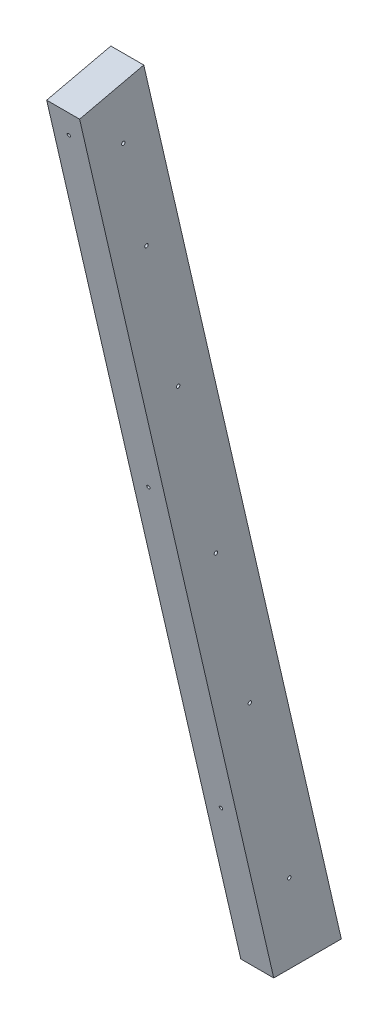
ISO-10303-21;
HEADER;
FILE_DESCRIPTION(('STEP AP214'),'2;1');
FILE_NAME('part.step','',(''),(''),'','','');
FILE_SCHEMA(('AUTOMOTIVE_DESIGN { 1 0 10303 214 1 1 1 1 }'));
ENDSEC;
DATA;
#1=APPLICATION_CONTEXT('core data for automotive mechanical design processes');
#2=APPLICATION_PROTOCOL_DEFINITION('international standard','automotive_design',2000,#1);
#3=PRODUCT_CONTEXT('',#1,'mechanical');
#4=PRODUCT('Part','Part','',(#3));
#5=PRODUCT_RELATED_PRODUCT_CATEGORY('part','',(#4));
#6=PRODUCT_DEFINITION_FORMATION('','',#4);
#7=PRODUCT_DEFINITION_CONTEXT('part definition',#1,'design');
#8=PRODUCT_DEFINITION('design','',#6,#7);
#9=PRODUCT_DEFINITION_SHAPE('','',#8);
#10=(LENGTH_UNIT() NAMED_UNIT(*) SI_UNIT(.MILLI.,.METRE.));
#11=(NAMED_UNIT(*) PLANE_ANGLE_UNIT() SI_UNIT($,.RADIAN.));
#12=(NAMED_UNIT(*) SI_UNIT($,.STERADIAN.) SOLID_ANGLE_UNIT());
#13=UNCERTAINTY_MEASURE_WITH_UNIT(LENGTH_MEASURE(1.E-05),#10,'distance_accuracy_value','');
#14=(GEOMETRIC_REPRESENTATION_CONTEXT(3) GLOBAL_UNCERTAINTY_ASSIGNED_CONTEXT((#13)) GLOBAL_UNIT_ASSIGNED_CONTEXT((#10,
#11,#12)) REPRESENTATION_CONTEXT('',''));
#15=CARTESIAN_POINT('',(0.,0.,0.));
#16=DIRECTION('',(0.,0.,1.));
#17=DIRECTION('',(1.,0.,0.));
#18=AXIS2_PLACEMENT_3D('',#15,#16,#17);
#19=CARTESIAN_POINT('',(312.420000000002,5194.3,3108.48437157349));
#20=DIRECTION('',(0.,-1.,0.));
#21=DIRECTION('',(0.,0.,-1.));
#22=AXIS2_PLACEMENT_3D('',#19,#20,#21);
#23=PLANE('',#22);
#24=DIRECTION('',(1.,0.,0.));
#25=VECTOR('',#24,1.);
#26=CARTESIAN_POINT('',(312.420000000001,5194.30000000001,3147.58655808041));
#27=LINE('',#26,#25);
#28=CARTESIAN_POINT('',(293.370000000002,5194.3,3147.58655808041));
#29=VERTEX_POINT('',#28);
#30=CARTESIAN_POINT('',(312.420000000001,5194.3,3147.58655808041));
#31=VERTEX_POINT('',#30);
#32=EDGE_CURVE('E56',#29,#31,#27,.T.);
#33=ORIENTED_EDGE('',*,*,#32,.F.);
#34=DIRECTION('',(0.,0.,1.));
#35=VECTOR('',#34,1.);
#36=CARTESIAN_POINT('',(293.370000000002,5194.30000000001,3108.48437157349));
#37=LINE('',#36,#35);
#38=CARTESIAN_POINT('',(293.370000000002,5194.30000000001,3108.48437157349));
#39=VERTEX_POINT('',#38);
#40=EDGE_CURVE('E146',#39,#29,#37,.T.);
#41=ORIENTED_EDGE('',*,*,#40,.F.);
#42=DIRECTION('',(1.,0.,0.));
#43=VECTOR('',#42,1.);
#44=CARTESIAN_POINT('',(312.420000000001,5194.3,3108.4843715735));
#45=LINE('',#44,#43);
#46=CARTESIAN_POINT('',(312.420000000001,5194.3,3108.48437157349));
#47=VERTEX_POINT('',#46);
#48=EDGE_CURVE('E156',#47,#39,#45,.F.);
#49=ORIENTED_EDGE('',*,*,#48,.F.);
#50=DIRECTION('',(0.,0.,1.));
#51=VECTOR('',#50,1.);
#52=CARTESIAN_POINT('',(312.420000000001,5194.3,3149.901148429));
#53=LINE('',#52,#51);
#54=EDGE_CURVE('E63',#47,#31,#53,.T.);
#55=ORIENTED_EDGE('',*,*,#54,.T.);
#56=EDGE_LOOP('',(#33,#41,#49,#55));
#57=FACE_BOUND('',#56,.T.);
#58=ADVANCED_FACE('F40',(#57),#23,.T.);
#59=CARTESIAN_POINT('',(312.420000000001,5194.30000000001,3147.58655808041));
#60=DIRECTION('',(0.,-0.224951054343807,0.974370064785249));
#61=DIRECTION('',(0.,-0.974370064785249,-0.224951054343807));
#62=AXIS2_PLACEMENT_3D('',#59,#60,#61);
#63=PLANE('',#62);
#64=CARTESIAN_POINT('',(302.895,5666.2037733247,3256.53412861318));
#65=DIRECTION('',(0.,-0.224951054343807,0.974370064785249));
#66=DIRECTION('',(0.,-0.974370064785249,-0.224951054343807));
#67=AXIS2_PLACEMENT_3D('',#64,#65,#66);
#68=CIRCLE('',#67,0.991870000000006);
#69=CARTESIAN_POINT('',(302.895,5665.23732488854,3256.31100641091));
#70=VERTEX_POINT('',#69);
#71=EDGE_CURVE('E43',#70,#70,#68,.T.);
#72=ORIENTED_EDGE('',*,*,#71,.F.);
#73=EDGE_LOOP('',(#72));
#74=FACE_BOUND('',#73,.T.);
#75=CARTESIAN_POINT('',(302.895000000003,5466.8797897085,3210.51656106778));
#76=DIRECTION('',(0.,-0.224951054343807,0.974370064785249));
#77=DIRECTION('',(0.,-0.974370064785249,-0.224951054343807));
#78=AXIS2_PLACEMENT_3D('',#75,#76,#77);
#79=CIRCLE('',#78,0.991870000000006);
#80=CARTESIAN_POINT('',(302.895000000003,5465.91334127234,3210.29343886551));
#81=VERTEX_POINT('',#80);
#82=EDGE_CURVE('E105',#81,#81,#79,.T.);
#83=ORIENTED_EDGE('',*,*,#82,.F.);
#84=EDGE_LOOP('',(#83));
#85=FACE_BOUND('',#84,.T.);
#86=CARTESIAN_POINT('',(302.895,5285.233909112,3168.58030518907));
#87=DIRECTION('',(0.,-0.224951054343807,0.974370064785249));
#88=DIRECTION('',(0.,-0.974370064785249,-0.224951054343807));
#89=AXIS2_PLACEMENT_3D('',#86,#87,#88);
#90=CIRCLE('',#89,0.991870000000006);
#91=CARTESIAN_POINT('',(302.895,5284.26746067584,3168.3571829868));
#92=VERTEX_POINT('',#91);
#93=EDGE_CURVE('E109',#92,#92,#90,.T.);
#94=ORIENTED_EDGE('',*,*,#93,.F.);
#95=EDGE_LOOP('',(#94));
#96=FACE_BOUND('',#95,.T.);
#97=DIRECTION('',(0.,0.974370064785226,0.224951054343907));
#98=VECTOR('',#97,1.);
#99=CARTESIAN_POINT('',(312.420000000001,5194.30000000001,3147.58655808041));
#100=LINE('',#99,#98);
#101=CARTESIAN_POINT('',(312.42,5680.70935774042,3259.88300664842));
#102=VERTEX_POINT('',#101);
#103=EDGE_CURVE('E48',#31,#102,#100,.T.);
#104=ORIENTED_EDGE('',*,*,#103,.T.);
#105=DIRECTION('',(1.,0.,-2.79887224508002E-13));
#106=VECTOR('',#105,1.);
#107=CARTESIAN_POINT('',(293.37,5680.70935774042,3259.88300664843));
#108=LINE('',#107,#106);
#109=CARTESIAN_POINT('',(293.37,5680.70935774042,3259.88300664843));
#110=VERTEX_POINT('',#109);
#111=EDGE_CURVE('E143',#110,#102,#108,.T.);
#112=ORIENTED_EDGE('',*,*,#111,.F.);
#113=DIRECTION('',(0.,0.974370064785232,0.224951054343881));
#114=VECTOR('',#113,1.);
#115=CARTESIAN_POINT('',(293.370000000002,5194.3,3147.58655808041));
#116=LINE('',#115,#114);
#117=EDGE_CURVE('E149',#29,#110,#116,.T.);
#118=ORIENTED_EDGE('',*,*,#117,.F.);
#119=ORIENTED_EDGE('',*,*,#32,.T.);
#120=EDGE_LOOP('',(#104,#112,#118,#119));
#121=FACE_BOUND('',#120,.T.);
#122=ADVANCED_FACE('F177',(#74,#85,#96,#121),#63,.T.);
#123=CARTESIAN_POINT('',(312.420000000001,5392.29199716437,3154.19442581616));
#124=DIRECTION('',(0.,0.224951054343805,-0.97437006478525));
#125=DIRECTION('',(0.,0.974370064785249,0.224951054343805));
#126=AXIS2_PLACEMENT_3D('',#123,#124,#125);
#127=PLANE('',#126);
#128=ORIENTED_EDGE('',*,*,#48,.T.);
#129=DIRECTION('',(0.,-0.974370064785238,-0.224951054343855));
#130=VECTOR('',#129,1.);
#131=CARTESIAN_POINT('',(293.370000000001,5392.29199716437,3154.19442581616));
#132=LINE('',#131,#130);
#133=CARTESIAN_POINT('',(293.37,5689.27999291091,3222.75950718011));
#134=VERTEX_POINT('',#133);
#135=EDGE_CURVE('E151',#134,#39,#132,.T.);
#136=ORIENTED_EDGE('',*,*,#135,.F.);
#137=DIRECTION('',(-1.,0.,0.));
#138=VECTOR('',#137,1.);
#139=CARTESIAN_POINT('',(312.42,5689.27999291091,3222.75950718011));
#140=LINE('',#139,#138);
#141=CARTESIAN_POINT('',(312.42,5689.27999291091,3222.75950718011));
#142=VERTEX_POINT('',#141);
#143=EDGE_CURVE('E137',#142,#134,#140,.T.);
#144=ORIENTED_EDGE('',*,*,#143,.F.);
#145=DIRECTION('',(0.,-0.974370064785234,-0.224951054343871));
#146=VECTOR('',#145,1.);
#147=CARTESIAN_POINT('',(312.420000000001,5392.29199716437,3154.19442581616));
#148=LINE('',#147,#146);
#149=EDGE_CURVE('E11',#142,#47,#148,.T.);
#150=ORIENTED_EDGE('',*,*,#149,.T.);
#151=EDGE_LOOP('',(#128,#136,#144,#150));
#152=FACE_BOUND('',#151,.T.);
#153=ADVANCED_FACE('F180',(#152),#127,.T.);
#154=CARTESIAN_POINT('',(312.420000000001,5293.29599858218,3149.90114842899));
#155=DIRECTION('',(-1.,0.,0.));
#156=DIRECTION('',(0.,0.,1.));
#157=AXIS2_PLACEMENT_3D('',#154,#155,#156);
#158=PLANE('',#157);
#159=CARTESIAN_POINT('',(312.420000000001,5655.98350649425,3234.62350084372));
#160=DIRECTION('',(-1.,0.,0.));
#161=DIRECTION('',(0.,0.,1.));
#162=AXIS2_PLACEMENT_3D('',#159,#160,#161);
#163=CIRCLE('',#162,0.991870000000006);
#164=CARTESIAN_POINT('',(312.420000000001,5655.98350649425,3235.61537084372));
#165=VERTEX_POINT('',#164);
#166=EDGE_CURVE('E110',#165,#165,#163,.T.);
#167=ORIENTED_EDGE('',*,*,#166,.T.);
#168=EDGE_LOOP('',(#167));
#169=FACE_BOUND('',#168,.T.);
#170=CARTESIAN_POINT('',(312.420000000002,5597.96116883142,3221.22798870264));
#171=DIRECTION('',(-1.,0.,0.));
#172=DIRECTION('',(0.,0.,1.));
#173=AXIS2_PLACEMENT_3D('',#170,#171,#172);
#174=CIRCLE('',#173,0.991870000000006);
#175=CARTESIAN_POINT('',(312.420000000002,5597.96116883142,3222.21985870264));
#176=VERTEX_POINT('',#175);
#177=EDGE_CURVE('E115',#176,#176,#174,.T.);
#178=ORIENTED_EDGE('',*,*,#177,.T.);
#179=EDGE_LOOP('',(#178));
#180=FACE_BOUND('',#179,.T.);
#181=CARTESIAN_POINT('',(312.420000000001,5518.40604291751,3202.86124068814));
#182=DIRECTION('',(-1.,0.,0.));
#183=DIRECTION('',(0.,0.,1.));
#184=AXIS2_PLACEMENT_3D('',#181,#182,#183);
#185=CIRCLE('',#184,0.991870000000006);
#186=CARTESIAN_POINT('',(312.420000000001,5518.40604291751,3203.85311068814));
#187=VERTEX_POINT('',#186);
#188=EDGE_CURVE('E118',#187,#187,#185,.T.);
#189=ORIENTED_EDGE('',*,*,#188,.T.);
#190=EDGE_LOOP('',(#189));
#191=FACE_BOUND('',#190,.T.);
#192=CARTESIAN_POINT('',(312.42,5423.92417167001,3181.04838197908));
#193=DIRECTION('',(-1.,0.,0.));
#194=DIRECTION('',(0.,0.,1.));
#195=AXIS2_PLACEMENT_3D('',#192,#193,#194);
#196=CIRCLE('',#195,0.991870000000006);
#197=CARTESIAN_POINT('',(312.42,5423.92417167001,3182.04025197908));
#198=VERTEX_POINT('',#197);
#199=EDGE_CURVE('E123',#198,#198,#196,.T.);
#200=ORIENTED_EDGE('',*,*,#199,.T.);
#201=EDGE_LOOP('',(#200));
#202=FACE_BOUND('',#201,.T.);
#203=CARTESIAN_POINT('',(312.42,5339.0676906789,3161.45771970739));
#204=DIRECTION('',(-1.,0.,0.));
#205=DIRECTION('',(0.,0.,1.));
#206=AXIS2_PLACEMENT_3D('',#203,#204,#205);
#207=CIRCLE('',#206,0.991870000000006);
#208=CARTESIAN_POINT('',(312.42,5339.0676906789,3162.44958970739));
#209=VERTEX_POINT('',#208);
#210=EDGE_CURVE('E127',#209,#209,#207,.T.);
#211=ORIENTED_EDGE('',*,*,#210,.T.);
#212=EDGE_LOOP('',(#211));
#213=FACE_BOUND('',#212,.T.);
#214=CARTESIAN_POINT('',(312.420000000001,5239.9707627156,3138.57939120242));
#215=DIRECTION('',(-1.,0.,0.));
#216=DIRECTION('',(0.,0.,1.));
#217=AXIS2_PLACEMENT_3D('',#214,#215,#216);
#218=CIRCLE('',#217,0.991870000000006);
#219=CARTESIAN_POINT('',(312.420000000001,5239.9707627156,3139.57126120242));
#220=VERTEX_POINT('',#219);
#221=EDGE_CURVE('E131',#220,#220,#218,.T.);
#222=ORIENTED_EDGE('',*,*,#221,.T.);
#223=EDGE_LOOP('',(#222));
#224=FACE_BOUND('',#223,.T.);
#225=ORIENTED_EDGE('',*,*,#149,.F.);
#226=DIRECTION('',(0.,0.224951054343675,-0.974370064785279));
#227=VECTOR('',#226,1.);
#228=CARTESIAN_POINT('',(312.42,5680.70935774042,3259.88300664842));
#229=LINE('',#228,#227);
#230=EDGE_CURVE('E134',#102,#142,#229,.T.);
#231=ORIENTED_EDGE('',*,*,#230,.F.);
#232=ORIENTED_EDGE('',*,*,#103,.F.);
#233=ORIENTED_EDGE('',*,*,#54,.F.);
#234=EDGE_LOOP('',(#225,#231,#232,#233));
#235=FACE_BOUND('',#234,.T.);
#236=ADVANCED_FACE('F188',(#169,#180,#191,#202,#213,#224,#235),#158,.F.);
#237=CARTESIAN_POINT('',(293.37,0.,-4.44089209850063E-13));
#238=DIRECTION('',(-1.,0.,0.));
#239=DIRECTION('',(0.,0.,1.));
#240=AXIS2_PLACEMENT_3D('',#237,#238,#239);
#241=PLANE('',#240);
#242=CARTESIAN_POINT('',(293.370000000001,5655.98350649425,3234.62350084372));
#243=DIRECTION('',(-1.,0.,0.));
#244=DIRECTION('',(0.,0.,1.));
#245=AXIS2_PLACEMENT_3D('',#242,#243,#244);
#246=CIRCLE('',#245,0.991870000000006);
#247=CARTESIAN_POINT('',(293.370000000001,5655.98350649425,3235.61537084372));
#248=VERTEX_POINT('',#247);
#249=EDGE_CURVE('E114',#248,#248,#246,.T.);
#250=ORIENTED_EDGE('',*,*,#249,.F.);
#251=EDGE_LOOP('',(#250));
#252=FACE_BOUND('',#251,.T.);
#253=CARTESIAN_POINT('',(293.370000000001,5597.96116883142,3221.22798870264));
#254=DIRECTION('',(-1.,0.,0.));
#255=DIRECTION('',(0.,0.,1.));
#256=AXIS2_PLACEMENT_3D('',#253,#254,#255);
#257=CIRCLE('',#256,0.991870000000006);
#258=CARTESIAN_POINT('',(293.370000000001,5597.96116883142,3222.21985870264));
#259=VERTEX_POINT('',#258);
#260=EDGE_CURVE('E113',#259,#259,#257,.T.);
#261=ORIENTED_EDGE('',*,*,#260,.F.);
#262=EDGE_LOOP('',(#261));
#263=FACE_BOUND('',#262,.T.);
#264=CARTESIAN_POINT('',(293.370000000001,5518.40604291751,3202.86124068814));
#265=DIRECTION('',(-1.,0.,0.));
#266=DIRECTION('',(0.,0.,1.));
#267=AXIS2_PLACEMENT_3D('',#264,#265,#266);
#268=CIRCLE('',#267,0.991870000000006);
#269=CARTESIAN_POINT('',(293.370000000001,5518.40604291751,3203.85311068814));
#270=VERTEX_POINT('',#269);
#271=EDGE_CURVE('E119',#270,#270,#268,.T.);
#272=ORIENTED_EDGE('',*,*,#271,.F.);
#273=EDGE_LOOP('',(#272));
#274=FACE_BOUND('',#273,.T.);
#275=CARTESIAN_POINT('',(293.37,5423.92417167001,3181.04838197908));
#276=DIRECTION('',(-1.,0.,0.));
#277=DIRECTION('',(0.,0.,1.));
#278=AXIS2_PLACEMENT_3D('',#275,#276,#277);
#279=CIRCLE('',#278,0.991870000000006);
#280=CARTESIAN_POINT('',(293.37,5423.92417167001,3182.04025197908));
#281=VERTEX_POINT('',#280);
#282=EDGE_CURVE('E122',#281,#281,#279,.T.);
#283=ORIENTED_EDGE('',*,*,#282,.F.);
#284=EDGE_LOOP('',(#283));
#285=FACE_BOUND('',#284,.T.);
#286=CARTESIAN_POINT('',(293.370000000001,5339.0676906789,3161.45771970739));
#287=DIRECTION('',(-1.,0.,0.));
#288=DIRECTION('',(0.,0.,1.));
#289=AXIS2_PLACEMENT_3D('',#286,#287,#288);
#290=CIRCLE('',#289,0.991870000000006);
#291=CARTESIAN_POINT('',(293.370000000001,5339.0676906789,3162.44958970739));
#292=VERTEX_POINT('',#291);
#293=EDGE_CURVE('E126',#292,#292,#290,.T.);
#294=ORIENTED_EDGE('',*,*,#293,.F.);
#295=EDGE_LOOP('',(#294));
#296=FACE_BOUND('',#295,.T.);
#297=CARTESIAN_POINT('',(293.37,5239.9707627156,3138.57939120242));
#298=DIRECTION('',(-1.,0.,0.));
#299=DIRECTION('',(0.,0.,1.));
#300=AXIS2_PLACEMENT_3D('',#297,#298,#299);
#301=CIRCLE('',#300,0.991870000000006);
#302=CARTESIAN_POINT('',(293.37,5239.9707627156,3139.57126120242));
#303=VERTEX_POINT('',#302);
#304=EDGE_CURVE('E130',#303,#303,#301,.T.);
#305=ORIENTED_EDGE('',*,*,#304,.F.);
#306=EDGE_LOOP('',(#305));
#307=FACE_BOUND('',#306,.T.);
#308=ORIENTED_EDGE('',*,*,#40,.T.);
#309=ORIENTED_EDGE('',*,*,#117,.T.);
#310=DIRECTION('',(0.,-0.224951054343666,0.974370064785281));
#311=VECTOR('',#310,1.);
#312=CARTESIAN_POINT('',(293.37,5689.27999291091,3222.75950718011));
#313=LINE('',#312,#311);
#314=EDGE_CURVE('E140',#134,#110,#313,.T.);
#315=ORIENTED_EDGE('',*,*,#314,.F.);
#316=ORIENTED_EDGE('',*,*,#135,.T.);
#317=EDGE_LOOP('',(#308,#309,#315,#316));
#318=FACE_BOUND('',#317,.T.);
#319=ADVANCED_FACE('F192',(#252,#263,#274,#285,#296,#307,#318),#241,.T.);
#320=CARTESIAN_POINT('',(2.22044604925031E-12,6107.767879628,1410.08932218327));
#321=DIRECTION('',(0.,0.974370064785279,0.224951054343675));
#322=DIRECTION('',(0.,-0.224951054343675,0.974370064785279));
#323=AXIS2_PLACEMENT_3D('',#320,#321,#322);
#324=PLANE('',#323);
#325=ORIENTED_EDGE('',*,*,#230,.T.);
#326=ORIENTED_EDGE('',*,*,#143,.T.);
#327=ORIENTED_EDGE('',*,*,#314,.T.);
#328=ORIENTED_EDGE('',*,*,#111,.T.);
#329=EDGE_LOOP('',(#325,#326,#327,#328));
#330=FACE_BOUND('',#329,.T.);
#331=ADVANCED_FACE('F186',(#330),#324,.T.);
#332=CARTESIAN_POINT('',(325.120000000001,5239.9707627156,3138.57939120242));
#333=DIRECTION('',(1.,0.,0.));
#334=DIRECTION('',(0.,0.,-1.));
#335=AXIS2_PLACEMENT_3D('',#332,#333,#334);
#336=CYLINDRICAL_SURFACE('',#335,0.991870000000006);
#337=ORIENTED_EDGE('',*,*,#304,.T.);
#338=EDGE_LOOP('',(#337));
#339=FACE_BOUND('',#338,.T.);
#340=ORIENTED_EDGE('',*,*,#221,.F.);
#341=EDGE_LOOP('',(#340));
#342=FACE_BOUND('',#341,.T.);
#343=ADVANCED_FACE('F212',(#339,#342),#336,.F.);
#344=CARTESIAN_POINT('',(325.120000000002,5339.0676906789,3161.45771970739));
#345=DIRECTION('',(1.,0.,0.));
#346=DIRECTION('',(0.,0.,-1.));
#347=AXIS2_PLACEMENT_3D('',#344,#345,#346);
#348=CYLINDRICAL_SURFACE('',#347,0.991870000000006);
#349=ORIENTED_EDGE('',*,*,#293,.T.);
#350=EDGE_LOOP('',(#349));
#351=FACE_BOUND('',#350,.T.);
#352=ORIENTED_EDGE('',*,*,#210,.F.);
#353=EDGE_LOOP('',(#352));
#354=FACE_BOUND('',#353,.T.);
#355=ADVANCED_FACE('F215',(#351,#354),#348,.F.);
#356=CARTESIAN_POINT('',(325.120000000001,5423.92417167001,3181.04838197908));
#357=DIRECTION('',(1.,0.,0.));
#358=DIRECTION('',(0.,0.,-1.));
#359=AXIS2_PLACEMENT_3D('',#356,#357,#358);
#360=CYLINDRICAL_SURFACE('',#359,0.991870000000006);
#361=ORIENTED_EDGE('',*,*,#282,.T.);
#362=EDGE_LOOP('',(#361));
#363=FACE_BOUND('',#362,.T.);
#364=ORIENTED_EDGE('',*,*,#199,.F.);
#365=EDGE_LOOP('',(#364));
#366=FACE_BOUND('',#365,.T.);
#367=ADVANCED_FACE('F219',(#363,#366),#360,.F.);
#368=CARTESIAN_POINT('',(325.12,5518.40604291751,3202.86124068814));
#369=DIRECTION('',(1.,0.,0.));
#370=DIRECTION('',(0.,0.,-1.));
#371=AXIS2_PLACEMENT_3D('',#368,#369,#370);
#372=CYLINDRICAL_SURFACE('',#371,0.991870000000006);
#373=ORIENTED_EDGE('',*,*,#271,.T.);
#374=EDGE_LOOP('',(#373));
#375=FACE_BOUND('',#374,.T.);
#376=ORIENTED_EDGE('',*,*,#188,.F.);
#377=EDGE_LOOP('',(#376));
#378=FACE_BOUND('',#377,.T.);
#379=ADVANCED_FACE('F223',(#375,#378),#372,.F.);
#380=CARTESIAN_POINT('',(325.120000000001,5597.96116883142,3221.22798870264));
#381=DIRECTION('',(1.,0.,0.));
#382=DIRECTION('',(0.,0.,-1.));
#383=AXIS2_PLACEMENT_3D('',#380,#381,#382);
#384=CYLINDRICAL_SURFACE('',#383,0.991870000000006);
#385=ORIENTED_EDGE('',*,*,#260,.T.);
#386=EDGE_LOOP('',(#385));
#387=FACE_BOUND('',#386,.T.);
#388=ORIENTED_EDGE('',*,*,#177,.F.);
#389=EDGE_LOOP('',(#388));
#390=FACE_BOUND('',#389,.T.);
#391=ADVANCED_FACE('F227',(#387,#390),#384,.F.);
#392=CARTESIAN_POINT('',(325.120000000002,5655.98350649425,3234.62350084372));
#393=DIRECTION('',(1.,0.,0.));
#394=DIRECTION('',(0.,0.,-1.));
#395=AXIS2_PLACEMENT_3D('',#392,#393,#394);
#396=CYLINDRICAL_SURFACE('',#395,0.991870000000006);
#397=ORIENTED_EDGE('',*,*,#249,.T.);
#398=EDGE_LOOP('',(#397));
#399=FACE_BOUND('',#398,.T.);
#400=ORIENTED_EDGE('',*,*,#166,.F.);
#401=EDGE_LOOP('',(#400));
#402=FACE_BOUND('',#401,.T.);
#403=ADVANCED_FACE('F231',(#399,#402),#396,.F.);
#404=CARTESIAN_POINT('',(302.895000000002,5289.51922669725,3150.01855545492));
#405=DIRECTION('',(0.,-0.224951054343807,0.974370064785249));
#406=DIRECTION('',(0.,-0.974370064785249,-0.224951054343807));
#407=AXIS2_PLACEMENT_3D('',#404,#405,#406);
#408=CONICAL_SURFACE('',#407,0.991870000000006,1.02974425867663);
#409=CARTESIAN_POINT('',(302.895000000002,5289.65329204182,3149.43785464932));
#410=VERTEX_POINT('',#409);
#411=VERTEX_LOOP('',#410);
#412=FACE_BOUND('',#411,.T.);
#413=CARTESIAN_POINT('',(302.895000000002,5289.51922669725,3150.01855545492));
#414=DIRECTION('',(0.,-0.224951054343807,0.974370064785249));
#415=DIRECTION('',(0.,-0.974370064785249,-0.224951054343807));
#416=AXIS2_PLACEMENT_3D('',#413,#414,#415);
#417=CIRCLE('',#416,0.991870000000006);
#418=CARTESIAN_POINT('',(302.895000000002,5288.55277826109,3149.79543325265));
#419=VERTEX_POINT('',#418);
#420=EDGE_CURVE('E106',#419,#419,#417,.T.);
#421=ORIENTED_EDGE('',*,*,#420,.T.);
#422=EDGE_LOOP('',(#421));
#423=FACE_BOUND('',#422,.T.);
#424=ADVANCED_FACE('F235',(#412,#423),#408,.F.);
#425=CARTESIAN_POINT('',(302.895000000001,5280.94859152675,3187.14205492324));
#426=DIRECTION('',(0.,-0.224951054343807,0.974370064785249));
#427=DIRECTION('',(0.,-0.974370064785249,-0.224951054343807));
#428=AXIS2_PLACEMENT_3D('',#425,#426,#427);
#429=CYLINDRICAL_SURFACE('',#428,0.991870000000006);
#430=ORIENTED_EDGE('',*,*,#93,.T.);
#431=EDGE_LOOP('',(#430));
#432=FACE_BOUND('',#431,.T.);
#433=ORIENTED_EDGE('',*,*,#420,.F.);
#434=EDGE_LOOP('',(#433));
#435=FACE_BOUND('',#434,.T.);
#436=ADVANCED_FACE('F239',(#432,#435),#429,.F.);
#437=CARTESIAN_POINT('',(302.895000000003,5471.16510729375,3191.95481133364));
#438=DIRECTION('',(0.,-0.224951054343807,0.974370064785249));
#439=DIRECTION('',(0.,-0.974370064785249,-0.224951054343807));
#440=AXIS2_PLACEMENT_3D('',#437,#438,#439);
#441=CONICAL_SURFACE('',#440,0.991870000000006,1.02974425867663);
#442=CARTESIAN_POINT('',(302.895000000004,5471.29917263833,3191.37411052803));
#443=VERTEX_POINT('',#442);
#444=VERTEX_LOOP('',#443);
#445=FACE_BOUND('',#444,.T.);
#446=CARTESIAN_POINT('',(302.895000000003,5471.16510729375,3191.95481133364));
#447=DIRECTION('',(0.,-0.224951054343807,0.974370064785249));
#448=DIRECTION('',(0.,-0.974370064785249,-0.224951054343807));
#449=AXIS2_PLACEMENT_3D('',#446,#447,#448);
#450=CIRCLE('',#449,0.991870000000006);
#451=CARTESIAN_POINT('',(302.895000000003,5470.19865885759,3191.73168913136));
#452=VERTEX_POINT('',#451);
#453=EDGE_CURVE('E101',#452,#452,#450,.T.);
#454=ORIENTED_EDGE('',*,*,#453,.T.);
#455=EDGE_LOOP('',(#454));
#456=FACE_BOUND('',#455,.T.);
#457=ADVANCED_FACE('F243',(#445,#456),#441,.F.);
#458=CARTESIAN_POINT('',(302.895000000004,5462.59447212325,3229.07831080195));
#459=DIRECTION('',(0.,-0.224951054343807,0.974370064785249));
#460=DIRECTION('',(0.,-0.974370064785249,-0.224951054343807));
#461=AXIS2_PLACEMENT_3D('',#458,#459,#460);
#462=CYLINDRICAL_SURFACE('',#461,0.991870000000006);
#463=ORIENTED_EDGE('',*,*,#82,.T.);
#464=EDGE_LOOP('',(#463));
#465=FACE_BOUND('',#464,.T.);
#466=ORIENTED_EDGE('',*,*,#453,.F.);
#467=EDGE_LOOP('',(#466));
#468=FACE_BOUND('',#467,.T.);
#469=ADVANCED_FACE('F93',(#465,#468),#462,.F.);
#470=CARTESIAN_POINT('',(302.895,5670.48909090995,3237.97237887904));
#471=DIRECTION('',(0.,-0.224951054343807,0.974370064785249));
#472=DIRECTION('',(0.,-0.974370064785249,-0.224951054343807));
#473=AXIS2_PLACEMENT_3D('',#470,#471,#472);
#474=CONICAL_SURFACE('',#473,0.991870000000006,1.02974425867663);
#475=CARTESIAN_POINT('',(302.895,5670.62315625453,3237.39167807343));
#476=VERTEX_POINT('',#475);
#477=VERTEX_LOOP('',#476);
#478=FACE_BOUND('',#477,.T.);
#479=CARTESIAN_POINT('',(302.895,5670.48909090995,3237.97237887904));
#480=DIRECTION('',(0.,-0.224951054343807,0.974370064785249));
#481=DIRECTION('',(0.,-0.974370064785249,-0.224951054343807));
#482=AXIS2_PLACEMENT_3D('',#479,#480,#481);
#483=CIRCLE('',#482,0.991870000000006);
#484=CARTESIAN_POINT('',(302.895,5669.52264247379,3237.74925667677));
#485=VERTEX_POINT('',#484);
#486=EDGE_CURVE('E97',#485,#485,#483,.T.);
#487=ORIENTED_EDGE('',*,*,#486,.T.);
#488=EDGE_LOOP('',(#487));
#489=FACE_BOUND('',#488,.T.);
#490=ADVANCED_FACE('F89',(#478,#489),#474,.F.);
#491=CARTESIAN_POINT('',(302.895,5661.91845573945,3275.09587834736));
#492=DIRECTION('',(0.,-0.224951054343807,0.974370064785249));
#493=DIRECTION('',(0.,-0.974370064785249,-0.224951054343807));
#494=AXIS2_PLACEMENT_3D('',#491,#492,#493);
#495=CYLINDRICAL_SURFACE('',#494,0.991870000000006);
#496=ORIENTED_EDGE('',*,*,#71,.T.);
#497=EDGE_LOOP('',(#496));
#498=FACE_BOUND('',#497,.T.);
#499=ORIENTED_EDGE('',*,*,#486,.F.);
#500=EDGE_LOOP('',(#499));
#501=FACE_BOUND('',#500,.T.);
#502=ADVANCED_FACE('F92',(#498,#501),#495,.F.);
#503=CLOSED_SHELL('',(#58,#122,#153,#236,#319,#331,#343,#355,#367,#379,#391,#403,#424,#436,#457,
#469,#490,#502));
#504=MANIFOLD_SOLID_BREP('B2',#503);
#505=ADVANCED_BREP_SHAPE_REPRESENTATION('',(#18,#504),#14);
#506=SHAPE_DEFINITION_REPRESENTATION(#9,#505);
ENDSEC;
END-ISO-10303-21;
